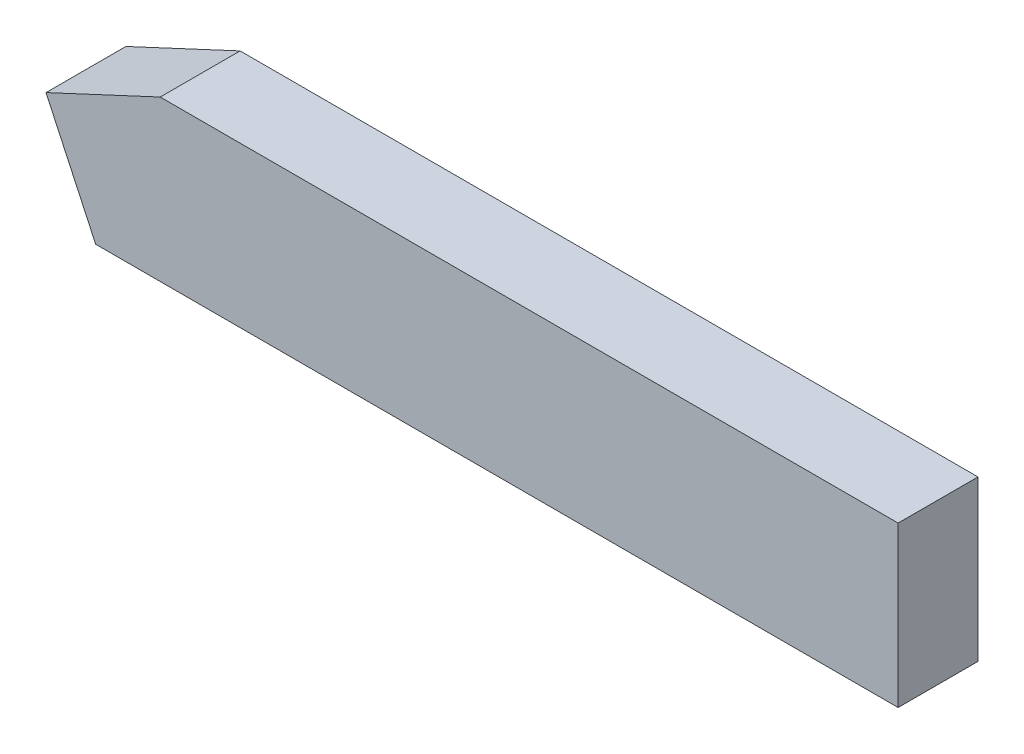
ISO-10303-21;
HEADER;
FILE_DESCRIPTION(('STEP AP214'),'2;1');
FILE_NAME('part.step','',(''),(''),'','','');
FILE_SCHEMA(('AUTOMOTIVE_DESIGN { 1 0 10303 214 1 1 1 1 }'));
ENDSEC;
DATA;
#1=APPLICATION_CONTEXT('core data for automotive mechanical design processes');
#2=APPLICATION_PROTOCOL_DEFINITION('international standard','automotive_design',2000,#1);
#3=PRODUCT_CONTEXT('',#1,'mechanical');
#4=PRODUCT('Part','Part','',(#3));
#5=PRODUCT_RELATED_PRODUCT_CATEGORY('part','',(#4));
#6=PRODUCT_DEFINITION_FORMATION('','',#4);
#7=PRODUCT_DEFINITION_CONTEXT('part definition',#1,'design');
#8=PRODUCT_DEFINITION('design','',#6,#7);
#9=PRODUCT_DEFINITION_SHAPE('','',#8);
#10=(LENGTH_UNIT() NAMED_UNIT(*) SI_UNIT(.MILLI.,.METRE.));
#11=(NAMED_UNIT(*) PLANE_ANGLE_UNIT() SI_UNIT($,.RADIAN.));
#12=(NAMED_UNIT(*) SI_UNIT($,.STERADIAN.) SOLID_ANGLE_UNIT());
#13=UNCERTAINTY_MEASURE_WITH_UNIT(LENGTH_MEASURE(1.E-05),#10,'distance_accuracy_value','');
#14=(GEOMETRIC_REPRESENTATION_CONTEXT(3) GLOBAL_UNCERTAINTY_ASSIGNED_CONTEXT((#13)) GLOBAL_UNIT_ASSIGNED_CONTEXT((#10,
#11,#12)) REPRESENTATION_CONTEXT('',''));
#15=CARTESIAN_POINT('',(0.,0.,0.));
#16=DIRECTION('',(0.,0.,1.));
#17=DIRECTION('',(1.,0.,0.));
#18=AXIS2_PLACEMENT_3D('',#15,#16,#17);
#19=CARTESIAN_POINT('',(256.25,329.,88.5));
#20=DIRECTION('',(0.,0.,-1.));
#21=DIRECTION('',(0.,-1.,0.));
#22=AXIS2_PLACEMENT_3D('',#19,#20,#21);
#23=PLANE('',#22);
#24=CARTESIAN_POINT('',(185.5761531631,314.,88.5));
#25=DIRECTION('',(1.,0.,0.));
#26=VECTOR('',#25,1.);
#27=LINE('',#24,#26);
#28=CARTESIAN_POINT('',(185.5761531631,314.,88.5));
#29=VERTEX_POINT('',#28);
#30=CARTESIAN_POINT('',(336.25,314.,88.5));
#31=VERTEX_POINT('',#30);
#32=EDGE_CURVE('E70',#29,#31,#27,.T.);
#33=ORIENTED_EDGE('',*,*,#32,.F.);
#34=CARTESIAN_POINT('',(185.5761531631,314.,88.5));
#35=DIRECTION('',(-0.42261826174072,0.90630778703664,0.));
#36=VECTOR('',#35,1.);
#37=LINE('',#34,#36);
#38=CARTESIAN_POINT('',(176.25,334.,88.5));
#39=VERTEX_POINT('',#38);
#40=EDGE_CURVE('E63',#29,#39,#37,.T.);
#41=ORIENTED_EDGE('',*,*,#40,.T.);
#42=CARTESIAN_POINT('',(176.25,333.999999999999,88.5));
#43=DIRECTION('',(0.906307787036664,0.42261826174067,0.));
#44=VECTOR('',#43,1.);
#45=LINE('',#42,#44);
#46=CARTESIAN_POINT('',(197.6950692051,344.,88.5));
#47=VERTEX_POINT('',#46);
#48=EDGE_CURVE('E66',#39,#47,#45,.T.);
#49=ORIENTED_EDGE('',*,*,#48,.T.);
#50=CARTESIAN_POINT('',(336.25,344.,88.5));
#51=DIRECTION('',(-1.,0.,0.));
#52=VECTOR('',#51,1.);
#53=LINE('',#50,#52);
#54=CARTESIAN_POINT('',(336.25,344.,88.5));
#55=VERTEX_POINT('',#54);
#56=EDGE_CURVE('E98',#55,#47,#53,.T.);
#57=ORIENTED_EDGE('',*,*,#56,.F.);
#58=CARTESIAN_POINT('',(336.25,314.,88.5));
#59=DIRECTION('',(0.,1.,0.));
#60=VECTOR('',#59,1.);
#61=LINE('',#58,#60);
#62=EDGE_CURVE('E245',#31,#55,#61,.T.);
#63=ORIENTED_EDGE('',*,*,#62,.F.);
#64=EDGE_LOOP('',(#33,#41,#49,#57,#63));
#65=FACE_BOUND('',#64,.T.);
#66=ADVANCED_FACE('F17',(#65),#23,.T.);
#67=CARTESIAN_POINT('',(176.25,334.,88.5));
#68=DIRECTION('',(0.906307787036641,0.422618261740719,0.));
#69=DIRECTION('',(0.,0.,-1.));
#70=AXIS2_PLACEMENT_3D('',#67,#68,#69);
#71=PLANE('',#70);
#72=ORIENTED_EDGE('',*,*,#40,.F.);
#73=CARTESIAN_POINT('',(185.5761531631,314.,103.5));
#74=DIRECTION('',(0.,0.,-1.));
#75=VECTOR('',#74,1.);
#76=LINE('',#73,#75);
#77=CARTESIAN_POINT('',(185.5761531631,314.,103.5));
#78=VERTEX_POINT('',#77);
#79=EDGE_CURVE('E149',#78,#29,#76,.T.);
#80=ORIENTED_EDGE('',*,*,#79,.F.);
#81=CARTESIAN_POINT('',(185.5761531631,314.,103.5));
#82=DIRECTION('',(-0.422618261740719,0.906307787036641,0.));
#83=VECTOR('',#82,1.);
#84=LINE('',#81,#83);
#85=CARTESIAN_POINT('',(176.25,334.,103.5));
#86=VERTEX_POINT('',#85);
#87=EDGE_CURVE('E83',#78,#86,#84,.T.);
#88=ORIENTED_EDGE('',*,*,#87,.T.);
#89=CARTESIAN_POINT('',(176.25,334.,103.5));
#90=DIRECTION('',(0.,0.,-1.));
#91=VECTOR('',#90,1.);
#92=LINE('',#89,#91);
#93=EDGE_CURVE('E77',#86,#39,#92,.T.);
#94=ORIENTED_EDGE('',*,*,#93,.T.);
#95=EDGE_LOOP('',(#72,#80,#88,#94));
#96=FACE_BOUND('',#95,.T.);
#97=ADVANCED_FACE('F81',(#96),#71,.F.);
#98=CARTESIAN_POINT('',(197.6950692051,344.,88.5));
#99=DIRECTION('',(0.422618261740681,-0.906307787036659,0.));
#100=DIRECTION('',(0.,0.,-1.));
#101=AXIS2_PLACEMENT_3D('',#98,#99,#100);
#102=PLANE('',#101);
#103=CARTESIAN_POINT('',(197.6950692051,344.,88.5));
#104=DIRECTION('',(0.,0.,1.));
#105=VECTOR('',#104,1.);
#106=LINE('',#103,#105);
#107=CARTESIAN_POINT('',(197.6950692051,344.,103.5));
#108=VERTEX_POINT('',#107);
#109=EDGE_CURVE('E94',#47,#108,#106,.T.);
#110=ORIENTED_EDGE('',*,*,#109,.F.);
#111=ORIENTED_EDGE('',*,*,#48,.F.);
#112=ORIENTED_EDGE('',*,*,#93,.F.);
#113=CARTESIAN_POINT('',(176.250000000001,333.999999999999,103.5));
#114=DIRECTION('',(0.906307787036658,0.422618261740682,0.));
#115=VECTOR('',#114,1.);
#116=LINE('',#113,#115);
#117=EDGE_CURVE('E131',#86,#108,#116,.T.);
#118=ORIENTED_EDGE('',*,*,#117,.T.);
#119=EDGE_LOOP('',(#110,#111,#112,#118));
#120=FACE_BOUND('',#119,.T.);
#121=ADVANCED_FACE('F92',(#120),#102,.F.);
#122=CARTESIAN_POINT('',(176.25,344.,103.5));
#123=DIRECTION('',(0.,1.,0.));
#124=DIRECTION('',(1.,0.,0.));
#125=AXIS2_PLACEMENT_3D('',#122,#123,#124);
#126=PLANE('',#125);
#127=ORIENTED_EDGE('',*,*,#56,.T.);
#128=ORIENTED_EDGE('',*,*,#109,.T.);
#129=CARTESIAN_POINT('',(197.6950692051,344.,103.5));
#130=DIRECTION('',(1.,0.,0.));
#131=VECTOR('',#130,1.);
#132=LINE('',#129,#131);
#133=CARTESIAN_POINT('',(336.25,344.,103.5));
#134=VERTEX_POINT('',#133);
#135=EDGE_CURVE('E300',#108,#134,#132,.T.);
#136=ORIENTED_EDGE('',*,*,#135,.T.);
#137=CARTESIAN_POINT('',(336.25,344.,88.5));
#138=DIRECTION('',(0.,0.,1.));
#139=VECTOR('',#138,1.);
#140=LINE('',#137,#139);
#141=EDGE_CURVE('E239',#55,#134,#140,.T.);
#142=ORIENTED_EDGE('',*,*,#141,.F.);
#143=EDGE_LOOP('',(#127,#128,#136,#142));
#144=FACE_BOUND('',#143,.T.);
#145=ADVANCED_FACE('F115',(#144),#126,.T.);
#146=CARTESIAN_POINT('',(336.25,344.,103.5));
#147=DIRECTION('',(1.,0.,0.));
#148=DIRECTION('',(0.,1.,0.));
#149=AXIS2_PLACEMENT_3D('',#146,#147,#148);
#150=PLANE('',#149);
#151=ORIENTED_EDGE('',*,*,#141,.T.);
#152=CARTESIAN_POINT('',(336.25,344.,103.5));
#153=DIRECTION('',(0.,-1.,0.));
#154=VECTOR('',#153,1.);
#155=LINE('',#152,#154);
#156=CARTESIAN_POINT('',(336.25,314.,103.5));
#157=VERTEX_POINT('',#156);
#158=EDGE_CURVE('E29',#134,#157,#155,.T.);
#159=ORIENTED_EDGE('',*,*,#158,.T.);
#160=CARTESIAN_POINT('',(336.25,314.,88.5));
#161=DIRECTION('',(0.,0.,1.));
#162=VECTOR('',#161,1.);
#163=LINE('',#160,#162);
#164=EDGE_CURVE('E167',#31,#157,#163,.T.);
#165=ORIENTED_EDGE('',*,*,#164,.F.);
#166=ORIENTED_EDGE('',*,*,#62,.T.);
#167=EDGE_LOOP('',(#151,#159,#165,#166));
#168=FACE_BOUND('',#167,.T.);
#169=ADVANCED_FACE('F304',(#168),#150,.T.);
#170=CARTESIAN_POINT('',(336.25,314.,103.5));
#171=DIRECTION('',(0.,-1.,0.));
#172=DIRECTION('',(0.,0.,-1.));
#173=AXIS2_PLACEMENT_3D('',#170,#171,#172);
#174=PLANE('',#173);
#175=CARTESIAN_POINT('',(336.25,314.,103.5));
#176=DIRECTION('',(-1.,0.,0.));
#177=VECTOR('',#176,1.);
#178=LINE('',#175,#177);
#179=EDGE_CURVE('E11',#157,#78,#178,.T.);
#180=ORIENTED_EDGE('',*,*,#179,.T.);
#181=ORIENTED_EDGE('',*,*,#79,.T.);
#182=ORIENTED_EDGE('',*,*,#32,.T.);
#183=ORIENTED_EDGE('',*,*,#164,.T.);
#184=EDGE_LOOP('',(#180,#181,#182,#183));
#185=FACE_BOUND('',#184,.T.);
#186=ADVANCED_FACE('F170',(#185),#174,.T.);
#187=CARTESIAN_POINT('',(256.25,329.,103.5));
#188=DIRECTION('',(0.,0.,-1.));
#189=DIRECTION('',(0.,-1.,0.));
#190=AXIS2_PLACEMENT_3D('',#187,#188,#189);
#191=PLANE('',#190);
#192=ORIENTED_EDGE('',*,*,#158,.F.);
#193=ORIENTED_EDGE('',*,*,#135,.F.);
#194=ORIENTED_EDGE('',*,*,#117,.F.);
#195=ORIENTED_EDGE('',*,*,#87,.F.);
#196=ORIENTED_EDGE('',*,*,#179,.F.);
#197=EDGE_LOOP('',(#192,#193,#194,#195,#196));
#198=FACE_BOUND('',#197,.T.);
#199=ADVANCED_FACE('F177',(#198),#191,.F.);
#200=CLOSED_SHELL('',(#66,#97,#121,#145,#169,#186,#199));
#201=MANIFOLD_SOLID_BREP('B1',#200);
#202=ADVANCED_BREP_SHAPE_REPRESENTATION('',(#18,#201),#14);
#203=SHAPE_DEFINITION_REPRESENTATION(#9,#202);
ENDSEC;
END-ISO-10303-21;
